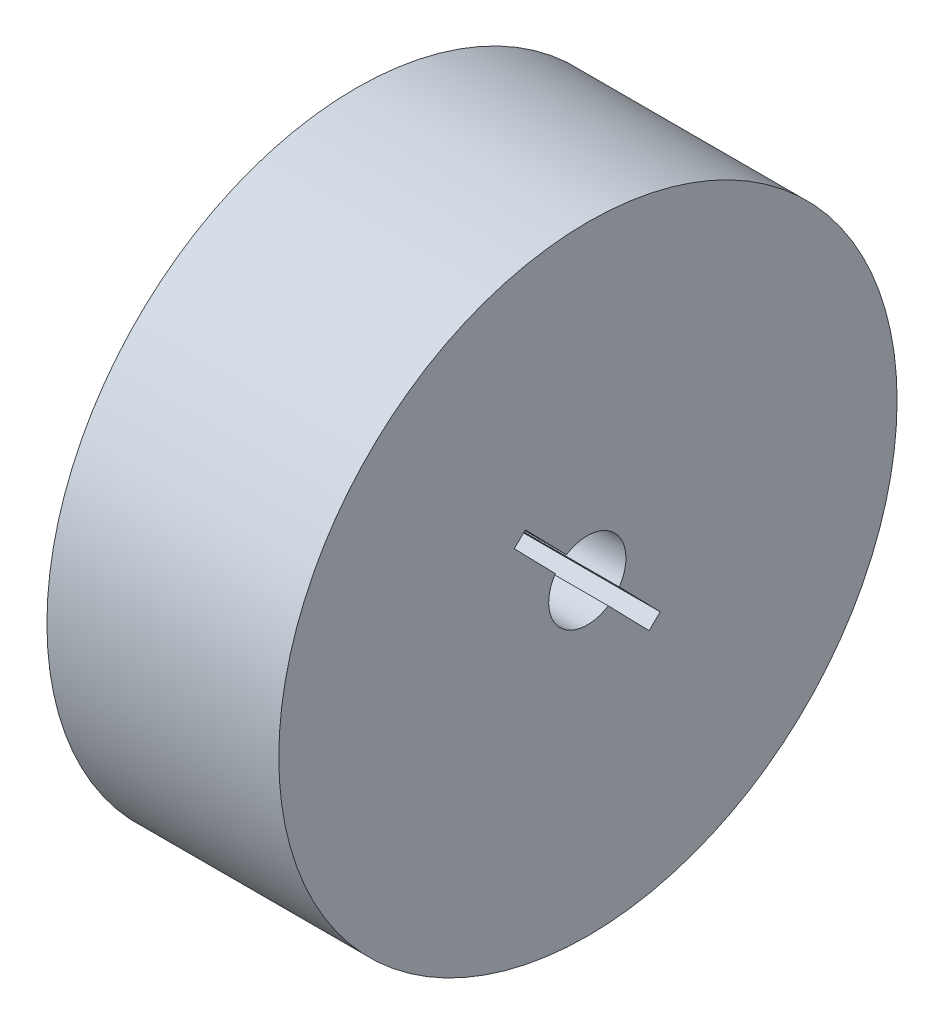
ISO-10303-21;
HEADER;
FILE_DESCRIPTION(('STEP AP214'),'2;1');
FILE_NAME('part.step','',(''),(''),'','','');
FILE_SCHEMA(('AUTOMOTIVE_DESIGN { 1 0 10303 214 1 1 1 1 }'));
ENDSEC;
DATA;
#1=APPLICATION_CONTEXT('core data for automotive mechanical design processes');
#2=APPLICATION_PROTOCOL_DEFINITION('international standard','automotive_design',2000,#1);
#3=PRODUCT_CONTEXT('',#1,'mechanical');
#4=PRODUCT('Part','Part','',(#3));
#5=PRODUCT_RELATED_PRODUCT_CATEGORY('part','',(#4));
#6=PRODUCT_DEFINITION_FORMATION('','',#4);
#7=PRODUCT_DEFINITION_CONTEXT('part definition',#1,'design');
#8=PRODUCT_DEFINITION('design','',#6,#7);
#9=PRODUCT_DEFINITION_SHAPE('','',#8);
#10=(LENGTH_UNIT() NAMED_UNIT(*) SI_UNIT(.MILLI.,.METRE.));
#11=(NAMED_UNIT(*) PLANE_ANGLE_UNIT() SI_UNIT($,.RADIAN.));
#12=(NAMED_UNIT(*) SI_UNIT($,.STERADIAN.) SOLID_ANGLE_UNIT());
#13=UNCERTAINTY_MEASURE_WITH_UNIT(LENGTH_MEASURE(1.E-05),#10,'distance_accuracy_value','');
#14=(GEOMETRIC_REPRESENTATION_CONTEXT(3) GLOBAL_UNCERTAINTY_ASSIGNED_CONTEXT((#13)) GLOBAL_UNIT_ASSIGNED_CONTEXT((#10,
#11,#12)) REPRESENTATION_CONTEXT('',''));
#15=CARTESIAN_POINT('',(0.,0.,0.));
#16=DIRECTION('',(0.,0.,1.));
#17=DIRECTION('',(1.,0.,0.));
#18=AXIS2_PLACEMENT_3D('',#15,#16,#17);
#19=CARTESIAN_POINT('',(30.,0.,0.));
#20=DIRECTION('',(1.,0.,0.));
#21=DIRECTION('',(0.,0.,-1.));
#22=AXIS2_PLACEMENT_3D('',#19,#20,#21);
#23=PLANE('',#22);
#24=CARTESIAN_POINT('',(30.,0.,0.));
#25=DIRECTION('',(1.,0.,0.));
#26=DIRECTION('',(0.,0.,-1.));
#27=AXIS2_PLACEMENT_3D('',#24,#25,#26);
#28=CIRCLE('',#27,40.);
#29=CARTESIAN_POINT('',(30.,0.,-40.));
#30=VERTEX_POINT('',#29);
#31=EDGE_CURVE('E13',#30,#30,#28,.T.);
#32=ORIENTED_EDGE('',*,*,#31,.T.);
#33=EDGE_LOOP('',(#32));
#34=FACE_BOUND('',#33,.T.);
#35=DIRECTION('',(0.,0.716251170960311,0.697842575440897));
#36=VECTOR('',#35,1.);
#37=CARTESIAN_POINT('',(30.,4.09215275080592,2.7813880720006));
#38=LINE('',#37,#36);
#39=CARTESIAN_POINT('',(30.,4.09215275080592,2.7813880720006));
#40=VERTEX_POINT('',#39);
#41=CARTESIAN_POINT('',(30.,9.5458926469176,8.09495969211349));
#42=VERTEX_POINT('',#41);
#43=EDGE_CURVE('E124',#40,#42,#38,.T.);
#44=ORIENTED_EDGE('',*,*,#43,.F.);
#45=CARTESIAN_POINT('',(30.,-0.115213187635479,0.0798936966514285));
#46=DIRECTION('',(1.,0.,0.));
#47=DIRECTION('',(0.,0.,-1.));
#48=AXIS2_PLACEMENT_3D('',#45,#46,#47);
#49=CIRCLE('',#48,5.);
#50=CARTESIAN_POINT('',(30.,-2.92531605178052,-4.05572256854092));
#51=VERTEX_POINT('',#50);
#52=EDGE_CURVE('E116',#51,#40,#49,.T.);
#53=ORIENTED_EDGE('',*,*,#52,.F.);
#54=DIRECTION('',(0.,0.716251170960311,0.697842575440897));
#55=VECTOR('',#54,1.);
#56=CARTESIAN_POINT('',(30.,-8.36038662709015,-9.35110469390893));
#57=LINE('',#56,#55);
#58=CARTESIAN_POINT('',(30.,-8.36038662709015,-9.35110469390893));
#59=VERTEX_POINT('',#58);
#60=EDGE_CURVE('E148',#59,#51,#57,.T.);
#61=ORIENTED_EDGE('',*,*,#60,.F.);
#62=DIRECTION('',(0.,0.697842575440896,-0.716251170960312));
#63=VECTOR('',#62,1.);
#64=CARTESIAN_POINT('',(30.,-9.756071777972,-7.91860235198832));
#65=LINE('',#64,#63);
#66=CARTESIAN_POINT('',(30.,-9.756071777972,-7.91860235198832));
#67=VERTEX_POINT('',#66);
#68=EDGE_CURVE('E146',#67,#59,#65,.T.);
#69=ORIENTED_EDGE('',*,*,#68,.F.);
#70=DIRECTION('',(0.,-0.716251170960311,-0.697842575440897));
#71=VECTOR('',#70,1.);
#72=CARTESIAN_POINT('',(30.,-4.32133179150684,-2.62354231889744));
#73=LINE('',#72,#71);
#74=CARTESIAN_POINT('',(30.,-4.32133179150684,-2.62354231889744));
#75=VERTEX_POINT('',#74);
#76=EDGE_CURVE('E144',#75,#67,#73,.T.);
#77=ORIENTED_EDGE('',*,*,#76,.F.);
#78=CARTESIAN_POINT('',(30.,-0.115213187635479,0.0798936966514285));
#79=DIRECTION('',(1.,0.,0.));
#80=DIRECTION('',(0.,0.,-1.));
#81=AXIS2_PLACEMENT_3D('',#78,#79,#80);
#82=CIRCLE('',#81,5.);
#83=CARTESIAN_POINT('',(30.,2.69679818876866,4.21421250619844));
#84=VERTEX_POINT('',#83);
#85=EDGE_CURVE('E142',#84,#75,#82,.T.);
#86=ORIENTED_EDGE('',*,*,#85,.F.);
#87=DIRECTION('',(0.,-0.716251170960311,-0.697842575440897));
#88=VECTOR('',#87,1.);
#89=CARTESIAN_POINT('',(30.,8.15020749603577,9.52746203403409));
#90=LINE('',#89,#88);
#91=CARTESIAN_POINT('',(30.,8.15020749603577,9.52746203403409));
#92=VERTEX_POINT('',#91);
#93=EDGE_CURVE('E138',#92,#84,#90,.T.);
#94=ORIENTED_EDGE('',*,*,#93,.F.);
#95=DIRECTION('',(0.,-0.697842575440897,0.716251170960311));
#96=VECTOR('',#95,1.);
#97=CARTESIAN_POINT('',(30.,9.5458926469176,8.09495969211349));
#98=LINE('',#97,#96);
#99=EDGE_CURVE('E136',#42,#92,#98,.T.);
#100=ORIENTED_EDGE('',*,*,#99,.F.);
#101=EDGE_LOOP('',(#44,#53,#61,#69,#77,#86,#94,#100));
#102=FACE_BOUND('',#101,.T.);
#103=ADVANCED_FACE('F51',(#34,#102),#23,.T.);
#104=CARTESIAN_POINT('',(0.,0.,0.));
#105=DIRECTION('',(1.,0.,0.));
#106=DIRECTION('',(0.,0.,-1.));
#107=AXIS2_PLACEMENT_3D('',#104,#105,#106);
#108=PLANE('',#107);
#109=CARTESIAN_POINT('',(0.,0.,0.));
#110=DIRECTION('',(1.,0.,0.));
#111=DIRECTION('',(0.,0.,-1.));
#112=AXIS2_PLACEMENT_3D('',#109,#110,#111);
#113=CIRCLE('',#112,40.);
#114=CARTESIAN_POINT('',(0.,0.,-40.));
#115=VERTEX_POINT('',#114);
#116=EDGE_CURVE('E55',#115,#115,#113,.T.);
#117=ORIENTED_EDGE('',*,*,#116,.F.);
#118=EDGE_LOOP('',(#117));
#119=FACE_BOUND('',#118,.T.);
#120=CARTESIAN_POINT('',(0.,-0.115213187635479,0.0798936966514285));
#121=DIRECTION('',(1.,0.,0.));
#122=DIRECTION('',(0.,0.,-1.));
#123=AXIS2_PLACEMENT_3D('',#120,#121,#122);
#124=CIRCLE('',#123,5.);
#125=CARTESIAN_POINT('',(0.,-2.92531605178052,-4.05572256854092));
#126=VERTEX_POINT('',#125);
#127=CARTESIAN_POINT('',(0.,4.09215275080592,2.7813880720006));
#128=VERTEX_POINT('',#127);
#129=EDGE_CURVE('E74',#126,#128,#124,.T.);
#130=ORIENTED_EDGE('',*,*,#129,.T.);
#131=DIRECTION('',(0.,0.716251170960311,0.697842575440897));
#132=VECTOR('',#131,1.);
#133=CARTESIAN_POINT('',(0.,4.09215275080592,2.7813880720006));
#134=LINE('',#133,#132);
#135=CARTESIAN_POINT('',(0.,9.5458926469176,8.09495969211349));
#136=VERTEX_POINT('',#135);
#137=EDGE_CURVE('E131',#128,#136,#134,.T.);
#138=ORIENTED_EDGE('',*,*,#137,.T.);
#139=DIRECTION('',(0.,-0.697842575440897,0.716251170960311));
#140=VECTOR('',#139,1.);
#141=CARTESIAN_POINT('',(0.,9.5458926469176,8.09495969211349));
#142=LINE('',#141,#140);
#143=CARTESIAN_POINT('',(0.,8.15020749603577,9.52746203403409));
#144=VERTEX_POINT('',#143);
#145=EDGE_CURVE('E152',#136,#144,#142,.T.);
#146=ORIENTED_EDGE('',*,*,#145,.T.);
#147=DIRECTION('',(0.,-0.716251170960311,-0.697842575440897));
#148=VECTOR('',#147,1.);
#149=CARTESIAN_POINT('',(0.,8.15020749603577,9.52746203403409));
#150=LINE('',#149,#148);
#151=CARTESIAN_POINT('',(0.,2.69679818876866,4.21421250619844));
#152=VERTEX_POINT('',#151);
#153=EDGE_CURVE('E155',#144,#152,#150,.T.);
#154=ORIENTED_EDGE('',*,*,#153,.T.);
#155=CARTESIAN_POINT('',(0.,-0.115213187635479,0.0798936966514285));
#156=DIRECTION('',(1.,0.,0.));
#157=DIRECTION('',(0.,0.,-1.));
#158=AXIS2_PLACEMENT_3D('',#155,#156,#157);
#159=CIRCLE('',#158,5.);
#160=CARTESIAN_POINT('',(0.,-4.32133179150684,-2.62354231889744));
#161=VERTEX_POINT('',#160);
#162=EDGE_CURVE('E158',#152,#161,#159,.T.);
#163=ORIENTED_EDGE('',*,*,#162,.T.);
#164=DIRECTION('',(0.,-0.716251170960311,-0.697842575440897));
#165=VECTOR('',#164,1.);
#166=CARTESIAN_POINT('',(0.,-4.32133179150684,-2.62354231889744));
#167=LINE('',#166,#165);
#168=CARTESIAN_POINT('',(0.,-9.756071777972,-7.91860235198832));
#169=VERTEX_POINT('',#168);
#170=EDGE_CURVE('E161',#161,#169,#167,.T.);
#171=ORIENTED_EDGE('',*,*,#170,.T.);
#172=DIRECTION('',(0.,0.697842575440896,-0.716251170960312));
#173=VECTOR('',#172,1.);
#174=CARTESIAN_POINT('',(0.,-9.756071777972,-7.91860235198832));
#175=LINE('',#174,#173);
#176=CARTESIAN_POINT('',(0.,-8.36038662709015,-9.35110469390893));
#177=VERTEX_POINT('',#176);
#178=EDGE_CURVE('E164',#169,#177,#175,.T.);
#179=ORIENTED_EDGE('',*,*,#178,.T.);
#180=DIRECTION('',(0.,0.716251170960311,0.697842575440897));
#181=VECTOR('',#180,1.);
#182=CARTESIAN_POINT('',(0.,-8.36038662709015,-9.35110469390893));
#183=LINE('',#182,#181);
#184=EDGE_CURVE('E125',#177,#126,#183,.T.);
#185=ORIENTED_EDGE('',*,*,#184,.T.);
#186=EDGE_LOOP('',(#130,#138,#146,#154,#163,#171,#179,#185));
#187=FACE_BOUND('',#186,.T.);
#188=ADVANCED_FACE('F185',(#119,#187),#108,.F.);
#189=CARTESIAN_POINT('',(30.,0.,0.));
#190=DIRECTION('',(-1.,0.,0.));
#191=DIRECTION('',(0.,0.,1.));
#192=AXIS2_PLACEMENT_3D('',#189,#190,#191);
#193=CYLINDRICAL_SURFACE('',#192,40.);
#194=ORIENTED_EDGE('',*,*,#31,.F.);
#195=EDGE_LOOP('',(#194));
#196=FACE_BOUND('',#195,.T.);
#197=ORIENTED_EDGE('',*,*,#116,.T.);
#198=EDGE_LOOP('',(#197));
#199=FACE_BOUND('',#198,.T.);
#200=ADVANCED_FACE('F53',(#196,#199),#193,.T.);
#201=CARTESIAN_POINT('',(30.,-0.115213187635479,0.0798936966514285));
#202=DIRECTION('',(-1.,0.,0.));
#203=DIRECTION('',(0.,0.,1.));
#204=AXIS2_PLACEMENT_3D('',#201,#202,#203);
#205=CYLINDRICAL_SURFACE('',#204,5.);
#206=ORIENTED_EDGE('',*,*,#129,.F.);
#207=DIRECTION('',(-1.,0.,0.));
#208=VECTOR('',#207,1.);
#209=CARTESIAN_POINT('',(30.,-2.92531605178052,-4.05572256854092));
#210=LINE('',#209,#208);
#211=EDGE_CURVE('E120',#51,#126,#210,.T.);
#212=ORIENTED_EDGE('',*,*,#211,.F.);
#213=ORIENTED_EDGE('',*,*,#52,.T.);
#214=DIRECTION('',(-1.,0.,0.));
#215=VECTOR('',#214,1.);
#216=CARTESIAN_POINT('',(30.,4.09215275080592,2.7813880720006));
#217=LINE('',#216,#215);
#218=EDGE_CURVE('E119',#40,#128,#217,.T.);
#219=ORIENTED_EDGE('',*,*,#218,.T.);
#220=EDGE_LOOP('',(#206,#212,#213,#219));
#221=FACE_BOUND('',#220,.T.);
#222=ADVANCED_FACE('F118',(#221),#205,.F.);
#223=CARTESIAN_POINT('',(30.,4.09215275080592,2.7813880720006));
#224=DIRECTION('',(0.,-0.697842575440897,0.716251170960311));
#225=DIRECTION('',(0.,-0.716251170960311,-0.697842575440897));
#226=AXIS2_PLACEMENT_3D('',#223,#224,#225);
#227=PLANE('',#226);
#228=ORIENTED_EDGE('',*,*,#137,.F.);
#229=ORIENTED_EDGE('',*,*,#218,.F.);
#230=ORIENTED_EDGE('',*,*,#43,.T.);
#231=DIRECTION('',(-1.,0.,0.));
#232=VECTOR('',#231,1.);
#233=CARTESIAN_POINT('',(30.,9.5458926469176,8.09495969211349));
#234=LINE('',#233,#232);
#235=EDGE_CURVE('E132',#42,#136,#234,.T.);
#236=ORIENTED_EDGE('',*,*,#235,.T.);
#237=EDGE_LOOP('',(#228,#229,#230,#236));
#238=FACE_BOUND('',#237,.T.);
#239=ADVANCED_FACE('F128',(#238),#227,.T.);
#240=CARTESIAN_POINT('',(30.,9.5458926469176,8.09495969211349));
#241=DIRECTION('',(0.,-0.716251170960311,-0.697842575440897));
#242=DIRECTION('',(0.,0.697842575440897,-0.716251170960311));
#243=AXIS2_PLACEMENT_3D('',#240,#241,#242);
#244=PLANE('',#243);
#245=ORIENTED_EDGE('',*,*,#145,.F.);
#246=ORIENTED_EDGE('',*,*,#235,.F.);
#247=ORIENTED_EDGE('',*,*,#99,.T.);
#248=DIRECTION('',(-1.,0.,0.));
#249=VECTOR('',#248,1.);
#250=CARTESIAN_POINT('',(30.,8.15020749603577,9.52746203403409));
#251=LINE('',#250,#249);
#252=EDGE_CURVE('E177',#92,#144,#251,.T.);
#253=ORIENTED_EDGE('',*,*,#252,.T.);
#254=EDGE_LOOP('',(#245,#246,#247,#253));
#255=FACE_BOUND('',#254,.T.);
#256=ADVANCED_FACE('F181',(#255),#244,.T.);
#257=CARTESIAN_POINT('',(30.,8.15020749603577,9.52746203403409));
#258=DIRECTION('',(0.,0.697842575440897,-0.716251170960311));
#259=DIRECTION('',(0.,0.716251170960311,0.697842575440897));
#260=AXIS2_PLACEMENT_3D('',#257,#258,#259);
#261=PLANE('',#260);
#262=ORIENTED_EDGE('',*,*,#153,.F.);
#263=ORIENTED_EDGE('',*,*,#252,.F.);
#264=ORIENTED_EDGE('',*,*,#93,.T.);
#265=DIRECTION('',(-1.,0.,0.));
#266=VECTOR('',#265,1.);
#267=CARTESIAN_POINT('',(30.,2.69679818876866,4.21421250619844));
#268=LINE('',#267,#266);
#269=EDGE_CURVE('E175',#84,#152,#268,.T.);
#270=ORIENTED_EDGE('',*,*,#269,.T.);
#271=EDGE_LOOP('',(#262,#263,#264,#270));
#272=FACE_BOUND('',#271,.T.);
#273=ADVANCED_FACE('F203',(#272),#261,.T.);
#274=CARTESIAN_POINT('',(30.,-0.115213187635479,0.0798936966514285));
#275=DIRECTION('',(-1.,0.,0.));
#276=DIRECTION('',(0.,0.,1.));
#277=AXIS2_PLACEMENT_3D('',#274,#275,#276);
#278=CYLINDRICAL_SURFACE('',#277,5.);
#279=ORIENTED_EDGE('',*,*,#162,.F.);
#280=ORIENTED_EDGE('',*,*,#269,.F.);
#281=ORIENTED_EDGE('',*,*,#85,.T.);
#282=DIRECTION('',(-1.,0.,0.));
#283=VECTOR('',#282,1.);
#284=CARTESIAN_POINT('',(30.,-4.32133179150684,-2.62354231889744));
#285=LINE('',#284,#283);
#286=EDGE_CURVE('E173',#75,#161,#285,.T.);
#287=ORIENTED_EDGE('',*,*,#286,.T.);
#288=EDGE_LOOP('',(#279,#280,#281,#287));
#289=FACE_BOUND('',#288,.T.);
#290=ADVANCED_FACE('F200',(#289),#278,.F.);
#291=CARTESIAN_POINT('',(30.,-4.32133179150684,-2.62354231889744));
#292=DIRECTION('',(0.,0.697842575440897,-0.716251170960311));
#293=DIRECTION('',(0.,0.716251170960311,0.697842575440897));
#294=AXIS2_PLACEMENT_3D('',#291,#292,#293);
#295=PLANE('',#294);
#296=ORIENTED_EDGE('',*,*,#170,.F.);
#297=ORIENTED_EDGE('',*,*,#286,.F.);
#298=ORIENTED_EDGE('',*,*,#76,.T.);
#299=DIRECTION('',(-1.,0.,0.));
#300=VECTOR('',#299,1.);
#301=CARTESIAN_POINT('',(30.,-9.756071777972,-7.91860235198832));
#302=LINE('',#301,#300);
#303=EDGE_CURVE('E171',#67,#169,#302,.T.);
#304=ORIENTED_EDGE('',*,*,#303,.T.);
#305=EDGE_LOOP('',(#296,#297,#298,#304));
#306=FACE_BOUND('',#305,.T.);
#307=ADVANCED_FACE('F196',(#306),#295,.T.);
#308=CARTESIAN_POINT('',(30.,-9.756071777972,-7.91860235198832));
#309=DIRECTION('',(0.,0.716251170960312,0.697842575440896));
#310=DIRECTION('',(0.,-0.697842575440896,0.716251170960312));
#311=AXIS2_PLACEMENT_3D('',#308,#309,#310);
#312=PLANE('',#311);
#313=ORIENTED_EDGE('',*,*,#178,.F.);
#314=ORIENTED_EDGE('',*,*,#303,.F.);
#315=ORIENTED_EDGE('',*,*,#68,.T.);
#316=DIRECTION('',(-1.,0.,0.));
#317=VECTOR('',#316,1.);
#318=CARTESIAN_POINT('',(30.,-8.36038662709015,-9.35110469390893));
#319=LINE('',#318,#317);
#320=EDGE_CURVE('E66',#59,#177,#319,.T.);
#321=ORIENTED_EDGE('',*,*,#320,.T.);
#322=EDGE_LOOP('',(#313,#314,#315,#321));
#323=FACE_BOUND('',#322,.T.);
#324=ADVANCED_FACE('F193',(#323),#312,.T.);
#325=CARTESIAN_POINT('',(30.,-8.36038662709015,-9.35110469390893));
#326=DIRECTION('',(0.,-0.697842575440897,0.716251170960311));
#327=DIRECTION('',(0.,-0.716251170960311,-0.697842575440897));
#328=AXIS2_PLACEMENT_3D('',#325,#326,#327);
#329=PLANE('',#328);
#330=ORIENTED_EDGE('',*,*,#184,.F.);
#331=ORIENTED_EDGE('',*,*,#320,.F.);
#332=ORIENTED_EDGE('',*,*,#60,.T.);
#333=ORIENTED_EDGE('',*,*,#211,.T.);
#334=EDGE_LOOP('',(#330,#331,#332,#333));
#335=FACE_BOUND('',#334,.T.);
#336=ADVANCED_FACE('F187',(#335),#329,.T.);
#337=CLOSED_SHELL('',(#103,#188,#200,#222,#239,#256,#273,#290,#307,#324,#336));
#338=MANIFOLD_SOLID_BREP('B2',#337);
#339=ADVANCED_BREP_SHAPE_REPRESENTATION('',(#18,#338),#14);
#340=SHAPE_DEFINITION_REPRESENTATION(#9,#339);
ENDSEC;
END-ISO-10303-21;
